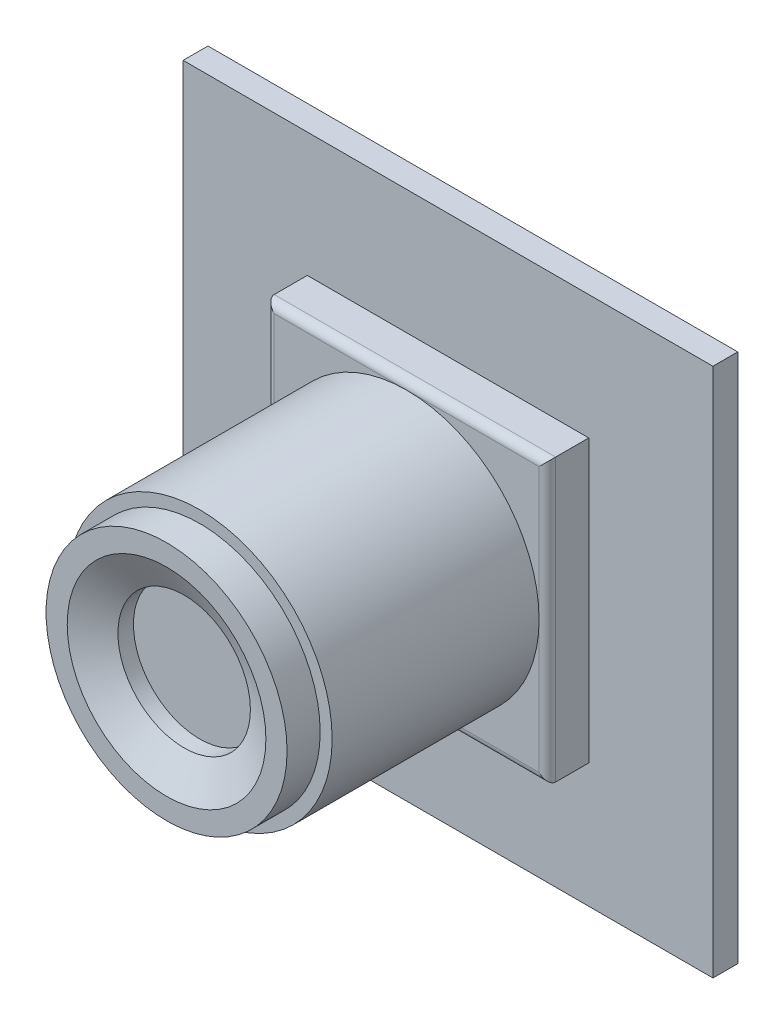
ISO-10303-21;
HEADER;
FILE_DESCRIPTION(('STEP AP214'),'2;1');
FILE_NAME('part.step','',(''),(''),'','','');
FILE_SCHEMA(('AUTOMOTIVE_DESIGN { 1 0 10303 214 1 1 1 1 }'));
ENDSEC;
DATA;
#1=APPLICATION_CONTEXT('core data for automotive mechanical design processes');
#2=APPLICATION_PROTOCOL_DEFINITION('international standard','automotive_design',2000,#1);
#3=PRODUCT_CONTEXT('',#1,'mechanical');
#4=PRODUCT('Part','Part','',(#3));
#5=PRODUCT_RELATED_PRODUCT_CATEGORY('part','',(#4));
#6=PRODUCT_DEFINITION_FORMATION('','',#4);
#7=PRODUCT_DEFINITION_CONTEXT('part definition',#1,'design');
#8=PRODUCT_DEFINITION('design','',#6,#7);
#9=PRODUCT_DEFINITION_SHAPE('','',#8);
#10=(LENGTH_UNIT() NAMED_UNIT(*) SI_UNIT(.MILLI.,.METRE.));
#11=(NAMED_UNIT(*) PLANE_ANGLE_UNIT() SI_UNIT($,.RADIAN.));
#12=(NAMED_UNIT(*) SI_UNIT($,.STERADIAN.) SOLID_ANGLE_UNIT());
#13=UNCERTAINTY_MEASURE_WITH_UNIT(LENGTH_MEASURE(1.E-05),#10,'distance_accuracy_value','');
#14=(GEOMETRIC_REPRESENTATION_CONTEXT(3) GLOBAL_UNCERTAINTY_ASSIGNED_CONTEXT((#13)) GLOBAL_UNIT_ASSIGNED_CONTEXT((#10,
#11,#12)) REPRESENTATION_CONTEXT('',''));
#15=CARTESIAN_POINT('',(0.,0.,0.));
#16=DIRECTION('',(0.,0.,1.));
#17=DIRECTION('',(1.,0.,0.));
#18=AXIS2_PLACEMENT_3D('',#15,#16,#17);
#19=CARTESIAN_POINT('',(0.,0.,4.));
#20=DIRECTION('',(0.,0.,-1.));
#21=DIRECTION('',(-1.,0.,0.));
#22=AXIS2_PLACEMENT_3D('',#19,#20,#21);
#23=PLANE('',#22);
#24=DIRECTION('',(0.,-1.,0.));
#25=VECTOR('',#24,1.);
#26=CARTESIAN_POINT('',(-8.,0.,4.));
#27=LINE('',#26,#25);
#28=CARTESIAN_POINT('',(-8.,0.,4.));
#29=VERTEX_POINT('',#28);
#30=CARTESIAN_POINT('',(-8.,-8.,4.));
#31=VERTEX_POINT('',#30);
#32=EDGE_CURVE('E207',#29,#31,#27,.T.);
#33=ORIENTED_EDGE('',*,*,#32,.T.);
#34=DIRECTION('',(1.,0.,0.));
#35=VECTOR('',#34,1.);
#36=CARTESIAN_POINT('',(0.,-8.,4.));
#37=LINE('',#36,#35);
#38=CARTESIAN_POINT('',(0.,-8.,4.));
#39=VERTEX_POINT('',#38);
#40=EDGE_CURVE('E211',#31,#39,#37,.T.);
#41=ORIENTED_EDGE('',*,*,#40,.T.);
#42=CARTESIAN_POINT('',(0.,0.,4.));
#43=DIRECTION('',(0.,0.,-1.));
#44=DIRECTION('',(-1.,0.,0.));
#45=AXIS2_PLACEMENT_3D('',#42,#43,#44);
#46=CIRCLE('',#45,8.);
#47=EDGE_CURVE('E186',#29,#39,#46,.F.);
#48=ORIENTED_EDGE('',*,*,#47,.F.);
#49=EDGE_LOOP('',(#33,#41,#48));
#50=FACE_BOUND('',#49,.T.);
#51=ADVANCED_FACE('F33',(#50),#23,.F.);
#52=CARTESIAN_POINT('',(8.,0.,4.));
#53=VERTEX_POINT('',#52);
#54=EDGE_CURVE('E190',#39,#53,#46,.F.);
#55=ORIENTED_EDGE('',*,*,#54,.F.);
#56=DIRECTION('',(1.,0.,0.));
#57=VECTOR('',#56,1.);
#58=CARTESIAN_POINT('',(0.,-8.,4.));
#59=LINE('',#58,#57);
#60=CARTESIAN_POINT('',(8.,-8.,4.));
#61=VERTEX_POINT('',#60);
#62=EDGE_CURVE('E209',#39,#61,#59,.T.);
#63=ORIENTED_EDGE('',*,*,#62,.T.);
#64=DIRECTION('',(0.,1.,0.));
#65=VECTOR('',#64,1.);
#66=CARTESIAN_POINT('',(8.,0.,4.));
#67=LINE('',#66,#65);
#68=EDGE_CURVE('E204',#61,#53,#67,.T.);
#69=ORIENTED_EDGE('',*,*,#68,.T.);
#70=EDGE_LOOP('',(#55,#63,#69));
#71=FACE_BOUND('',#70,.T.);
#72=ADVANCED_FACE('F269',(#71),#23,.F.);
#73=CARTESIAN_POINT('',(0.,8.,4.));
#74=VERTEX_POINT('',#73);
#75=EDGE_CURVE('E257',#53,#74,#46,.F.);
#76=ORIENTED_EDGE('',*,*,#75,.F.);
#77=DIRECTION('',(0.,1.,0.));
#78=VECTOR('',#77,1.);
#79=CARTESIAN_POINT('',(8.,0.,4.));
#80=LINE('',#79,#78);
#81=CARTESIAN_POINT('',(8.,8.,4.));
#82=VERTEX_POINT('',#81);
#83=EDGE_CURVE('E202',#53,#82,#80,.T.);
#84=ORIENTED_EDGE('',*,*,#83,.T.);
#85=DIRECTION('',(-1.,0.,0.));
#86=VECTOR('',#85,1.);
#87=CARTESIAN_POINT('',(0.,8.,4.));
#88=LINE('',#87,#86);
#89=EDGE_CURVE('E198',#82,#74,#88,.T.);
#90=ORIENTED_EDGE('',*,*,#89,.T.);
#91=EDGE_LOOP('',(#76,#84,#90));
#92=FACE_BOUND('',#91,.T.);
#93=ADVANCED_FACE('F255',(#92),#23,.F.);
#94=CARTESIAN_POINT('',(0.,0.,16.5));
#95=DIRECTION('',(0.,0.,1.));
#96=DIRECTION('',(1.,0.,0.));
#97=AXIS2_PLACEMENT_3D('',#94,#95,#96);
#98=PLANE('',#97);
#99=CARTESIAN_POINT('',(0.,0.,16.5));
#100=DIRECTION('',(0.,0.,1.));
#101=DIRECTION('',(1.,0.,0.));
#102=AXIS2_PLACEMENT_3D('',#99,#100,#101);
#103=CIRCLE('',#102,8.);
#104=CARTESIAN_POINT('',(8.,0.,16.5));
#105=VERTEX_POINT('',#104);
#106=EDGE_CURVE('E142',#105,#105,#103,.T.);
#107=ORIENTED_EDGE('',*,*,#106,.T.);
#108=EDGE_LOOP('',(#107));
#109=FACE_BOUND('',#108,.T.);
#110=CARTESIAN_POINT('',(0.,0.,16.5));
#111=DIRECTION('',(0.,0.,1.));
#112=DIRECTION('',(1.,0.,0.));
#113=AXIS2_PLACEMENT_3D('',#110,#111,#112);
#114=CIRCLE('',#113,7.27777031450188);
#115=CARTESIAN_POINT('',(7.27777031450188,0.,16.5));
#116=VERTEX_POINT('',#115);
#117=EDGE_CURVE('E232',#116,#116,#114,.T.);
#118=ORIENTED_EDGE('',*,*,#117,.F.);
#119=EDGE_LOOP('',(#118));
#120=FACE_BOUND('',#119,.T.);
#121=ADVANCED_FACE('F288',(#109,#120),#98,.T.);
#122=DIRECTION('',(-1.,0.,0.));
#123=VECTOR('',#122,1.);
#124=CARTESIAN_POINT('',(0.,8.,4.));
#125=LINE('',#124,#123);
#126=CARTESIAN_POINT('',(-8.,8.,4.));
#127=VERTEX_POINT('',#126);
#128=EDGE_CURVE('E196',#74,#127,#125,.T.);
#129=ORIENTED_EDGE('',*,*,#128,.T.);
#130=DIRECTION('',(0.,-1.,0.));
#131=VECTOR('',#130,1.);
#132=CARTESIAN_POINT('',(-8.,0.,4.));
#133=LINE('',#132,#131);
#134=EDGE_CURVE('E200',#127,#29,#133,.T.);
#135=ORIENTED_EDGE('',*,*,#134,.T.);
#136=EDGE_CURVE('E185',#74,#29,#46,.F.);
#137=ORIENTED_EDGE('',*,*,#136,.F.);
#138=EDGE_LOOP('',(#129,#135,#137));
#139=FACE_BOUND('',#138,.T.);
#140=ADVANCED_FACE('F261',(#139),#23,.F.);
#141=CARTESIAN_POINT('',(0.,0.,1.5));
#142=DIRECTION('',(0.,0.,-1.));
#143=DIRECTION('',(-1.,0.,0.));
#144=AXIS2_PLACEMENT_3D('',#141,#142,#143);
#145=PLANE('',#144);
#146=DIRECTION('',(0.,1.,0.));
#147=VECTOR('',#146,1.);
#148=CARTESIAN_POINT('',(16.,-16.,1.5));
#149=LINE('',#148,#147);
#150=CARTESIAN_POINT('',(16.,-16.,1.5));
#151=VERTEX_POINT('',#150);
#152=CARTESIAN_POINT('',(16.,16.,1.5));
#153=VERTEX_POINT('',#152);
#154=EDGE_CURVE('E156',#151,#153,#149,.T.);
#155=ORIENTED_EDGE('',*,*,#154,.T.);
#156=DIRECTION('',(-1.,0.,0.));
#157=VECTOR('',#156,1.);
#158=CARTESIAN_POINT('',(-16.,16.,1.5));
#159=LINE('',#158,#157);
#160=CARTESIAN_POINT('',(-16.,16.,1.5));
#161=VERTEX_POINT('',#160);
#162=EDGE_CURVE('E159',#153,#161,#159,.T.);
#163=ORIENTED_EDGE('',*,*,#162,.T.);
#164=DIRECTION('',(0.,-1.,0.));
#165=VECTOR('',#164,1.);
#166=CARTESIAN_POINT('',(-16.,-16.,1.5));
#167=LINE('',#166,#165);
#168=CARTESIAN_POINT('',(-16.,-16.,1.5));
#169=VERTEX_POINT('',#168);
#170=EDGE_CURVE('E162',#161,#169,#167,.T.);
#171=ORIENTED_EDGE('',*,*,#170,.T.);
#172=DIRECTION('',(1.,0.,0.));
#173=VECTOR('',#172,1.);
#174=CARTESIAN_POINT('',(-16.,-16.,1.5));
#175=LINE('',#174,#173);
#176=EDGE_CURVE('E164',#169,#151,#175,.T.);
#177=ORIENTED_EDGE('',*,*,#176,.T.);
#178=EDGE_LOOP('',(#155,#163,#171,#177));
#179=FACE_BOUND('',#178,.T.);
#180=DIRECTION('',(0.,1.,0.));
#181=VECTOR('',#180,1.);
#182=CARTESIAN_POINT('',(8.5,-8.5,1.5));
#183=LINE('',#182,#181);
#184=CARTESIAN_POINT('',(8.5,-8.5,1.5));
#185=VERTEX_POINT('',#184);
#186=CARTESIAN_POINT('',(8.5,8.5,1.5));
#187=VERTEX_POINT('',#186);
#188=EDGE_CURVE('E127',#185,#187,#183,.T.);
#189=ORIENTED_EDGE('',*,*,#188,.F.);
#190=DIRECTION('',(1.,0.,0.));
#191=VECTOR('',#190,1.);
#192=CARTESIAN_POINT('',(-8.5,-8.5,1.5));
#193=LINE('',#192,#191);
#194=CARTESIAN_POINT('',(-8.5,-8.5,1.5));
#195=VERTEX_POINT('',#194);
#196=EDGE_CURVE('E132',#195,#185,#193,.T.);
#197=ORIENTED_EDGE('',*,*,#196,.F.);
#198=DIRECTION('',(0.,-1.,0.));
#199=VECTOR('',#198,1.);
#200=CARTESIAN_POINT('',(-8.5,-8.5,1.5));
#201=LINE('',#200,#199);
#202=CARTESIAN_POINT('',(-8.5,8.5,1.5));
#203=VERTEX_POINT('',#202);
#204=EDGE_CURVE('E145',#203,#195,#201,.T.);
#205=ORIENTED_EDGE('',*,*,#204,.F.);
#206=DIRECTION('',(-1.,0.,0.));
#207=VECTOR('',#206,1.);
#208=CARTESIAN_POINT('',(-8.5,8.5,1.5));
#209=LINE('',#208,#207);
#210=EDGE_CURVE('E141',#187,#203,#209,.T.);
#211=ORIENTED_EDGE('',*,*,#210,.F.);
#212=EDGE_LOOP('',(#189,#197,#205,#211));
#213=FACE_BOUND('',#212,.T.);
#214=ADVANCED_FACE('F137',(#179,#213),#145,.F.);
#215=CARTESIAN_POINT('',(16.,-16.,1.5));
#216=DIRECTION('',(-1.,0.,0.));
#217=DIRECTION('',(0.,0.,1.));
#218=AXIS2_PLACEMENT_3D('',#215,#216,#217);
#219=PLANE('',#218);
#220=DIRECTION('',(0.,1.,0.));
#221=VECTOR('',#220,1.);
#222=CARTESIAN_POINT('',(16.,-16.,0.));
#223=LINE('',#222,#221);
#224=CARTESIAN_POINT('',(16.,-16.,0.));
#225=VERTEX_POINT('',#224);
#226=CARTESIAN_POINT('',(16.,16.,0.));
#227=VERTEX_POINT('',#226);
#228=EDGE_CURVE('E155',#225,#227,#223,.T.);
#229=ORIENTED_EDGE('',*,*,#228,.T.);
#230=DIRECTION('',(0.,0.,-1.));
#231=VECTOR('',#230,1.);
#232=CARTESIAN_POINT('',(16.,16.,1.5));
#233=LINE('',#232,#231);
#234=EDGE_CURVE('E182',#153,#227,#233,.T.);
#235=ORIENTED_EDGE('',*,*,#234,.F.);
#236=ORIENTED_EDGE('',*,*,#154,.F.);
#237=DIRECTION('',(0.,0.,-1.));
#238=VECTOR('',#237,1.);
#239=CARTESIAN_POINT('',(16.,-16.,1.5));
#240=LINE('',#239,#238);
#241=EDGE_CURVE('E166',#151,#225,#240,.T.);
#242=ORIENTED_EDGE('',*,*,#241,.T.);
#243=EDGE_LOOP('',(#229,#235,#236,#242));
#244=FACE_BOUND('',#243,.T.);
#245=ADVANCED_FACE('F293',(#244),#219,.F.);
#246=CARTESIAN_POINT('',(-16.,16.,1.5));
#247=DIRECTION('',(0.,-1.,0.));
#248=DIRECTION('',(0.,0.,-1.));
#249=AXIS2_PLACEMENT_3D('',#246,#247,#248);
#250=PLANE('',#249);
#251=DIRECTION('',(-1.,0.,0.));
#252=VECTOR('',#251,1.);
#253=CARTESIAN_POINT('',(-16.,16.,0.));
#254=LINE('',#253,#252);
#255=CARTESIAN_POINT('',(-16.,16.,0.));
#256=VERTEX_POINT('',#255);
#257=EDGE_CURVE('E169',#227,#256,#254,.T.);
#258=ORIENTED_EDGE('',*,*,#257,.T.);
#259=DIRECTION('',(0.,0.,-1.));
#260=VECTOR('',#259,1.);
#261=CARTESIAN_POINT('',(-16.,16.,1.5));
#262=LINE('',#261,#260);
#263=EDGE_CURVE('E179',#161,#256,#262,.T.);
#264=ORIENTED_EDGE('',*,*,#263,.F.);
#265=ORIENTED_EDGE('',*,*,#162,.F.);
#266=ORIENTED_EDGE('',*,*,#234,.T.);
#267=EDGE_LOOP('',(#258,#264,#265,#266));
#268=FACE_BOUND('',#267,.T.);
#269=ADVANCED_FACE('F402',(#268),#250,.F.);
#270=CARTESIAN_POINT('',(-16.,-16.,1.5));
#271=DIRECTION('',(1.,0.,0.));
#272=DIRECTION('',(0.,0.,-1.));
#273=AXIS2_PLACEMENT_3D('',#270,#271,#272);
#274=PLANE('',#273);
#275=DIRECTION('',(0.,-1.,0.));
#276=VECTOR('',#275,1.);
#277=CARTESIAN_POINT('',(-16.,-16.,0.));
#278=LINE('',#277,#276);
#279=CARTESIAN_POINT('',(-16.,-16.,0.));
#280=VERTEX_POINT('',#279);
#281=EDGE_CURVE('E171',#256,#280,#278,.T.);
#282=ORIENTED_EDGE('',*,*,#281,.T.);
#283=DIRECTION('',(0.,0.,-1.));
#284=VECTOR('',#283,1.);
#285=CARTESIAN_POINT('',(-16.,-16.,1.5));
#286=LINE('',#285,#284);
#287=EDGE_CURVE('E176',#169,#280,#286,.T.);
#288=ORIENTED_EDGE('',*,*,#287,.F.);
#289=ORIENTED_EDGE('',*,*,#170,.F.);
#290=ORIENTED_EDGE('',*,*,#263,.T.);
#291=EDGE_LOOP('',(#282,#288,#289,#290));
#292=FACE_BOUND('',#291,.T.);
#293=ADVANCED_FACE('F406',(#292),#274,.F.);
#294=CARTESIAN_POINT('',(-16.,-16.,1.5));
#295=DIRECTION('',(0.,1.,0.));
#296=DIRECTION('',(0.,0.,1.));
#297=AXIS2_PLACEMENT_3D('',#294,#295,#296);
#298=PLANE('',#297);
#299=DIRECTION('',(1.,0.,0.));
#300=VECTOR('',#299,1.);
#301=CARTESIAN_POINT('',(-16.,-16.,0.));
#302=LINE('',#301,#300);
#303=EDGE_CURVE('E160',#280,#225,#302,.T.);
#304=ORIENTED_EDGE('',*,*,#303,.T.);
#305=ORIENTED_EDGE('',*,*,#241,.F.);
#306=ORIENTED_EDGE('',*,*,#176,.F.);
#307=ORIENTED_EDGE('',*,*,#287,.T.);
#308=EDGE_LOOP('',(#304,#305,#306,#307));
#309=FACE_BOUND('',#308,.T.);
#310=ADVANCED_FACE('F410',(#309),#298,.F.);
#311=CARTESIAN_POINT('',(0.,0.,0.));
#312=DIRECTION('',(0.,0.,-1.));
#313=DIRECTION('',(-1.,0.,0.));
#314=AXIS2_PLACEMENT_3D('',#311,#312,#313);
#315=PLANE('',#314);
#316=ORIENTED_EDGE('',*,*,#228,.F.);
#317=ORIENTED_EDGE('',*,*,#303,.F.);
#318=ORIENTED_EDGE('',*,*,#281,.F.);
#319=ORIENTED_EDGE('',*,*,#257,.F.);
#320=EDGE_LOOP('',(#316,#317,#318,#319));
#321=FACE_BOUND('',#320,.T.);
#322=ADVANCED_FACE('F414',(#321),#315,.T.);
#323=CARTESIAN_POINT('',(8.5,-8.5,4.));
#324=DIRECTION('',(-1.,0.,0.));
#325=DIRECTION('',(0.,0.,1.));
#326=AXIS2_PLACEMENT_3D('',#323,#324,#325);
#327=PLANE('',#326);
#328=DIRECTION('',(0.,0.,-1.));
#329=VECTOR('',#328,1.);
#330=CARTESIAN_POINT('',(8.5,8.5,4.));
#331=LINE('',#330,#329);
#332=CARTESIAN_POINT('',(8.5,8.5,3.5));
#333=VERTEX_POINT('',#332);
#334=EDGE_CURVE('E153',#333,#187,#331,.T.);
#335=ORIENTED_EDGE('',*,*,#334,.F.);
#336=DIRECTION('',(0.,1.,0.));
#337=VECTOR('',#336,1.);
#338=CARTESIAN_POINT('',(8.5,-8.5,3.5));
#339=LINE('',#338,#337);
#340=CARTESIAN_POINT('',(8.5,-8.5,3.5));
#341=VERTEX_POINT('',#340);
#342=EDGE_CURVE('E129',#333,#341,#339,.F.);
#343=ORIENTED_EDGE('',*,*,#342,.T.);
#344=DIRECTION('',(0.,0.,-1.));
#345=VECTOR('',#344,1.);
#346=CARTESIAN_POINT('',(8.5,-8.5,4.));
#347=LINE('',#346,#345);
#348=EDGE_CURVE('E123',#341,#185,#347,.T.);
#349=ORIENTED_EDGE('',*,*,#348,.T.);
#350=ORIENTED_EDGE('',*,*,#188,.T.);
#351=EDGE_LOOP('',(#335,#343,#349,#350));
#352=FACE_BOUND('',#351,.T.);
#353=ADVANCED_FACE('F126',(#352),#327,.F.);
#354=CARTESIAN_POINT('',(-8.5,8.5,4.));
#355=DIRECTION('',(0.,-1.,0.));
#356=DIRECTION('',(0.,0.,-1.));
#357=AXIS2_PLACEMENT_3D('',#354,#355,#356);
#358=PLANE('',#357);
#359=DIRECTION('',(0.,0.,-1.));
#360=VECTOR('',#359,1.);
#361=CARTESIAN_POINT('',(-8.5,8.5,4.));
#362=LINE('',#361,#360);
#363=CARTESIAN_POINT('',(-8.5,8.5,3.5));
#364=VERTEX_POINT('',#363);
#365=EDGE_CURVE('E151',#364,#203,#362,.T.);
#366=ORIENTED_EDGE('',*,*,#365,.F.);
#367=DIRECTION('',(-1.,0.,0.));
#368=VECTOR('',#367,1.);
#369=CARTESIAN_POINT('',(-8.5,8.5,3.5));
#370=LINE('',#369,#368);
#371=EDGE_CURVE('E11',#364,#333,#370,.F.);
#372=ORIENTED_EDGE('',*,*,#371,.T.);
#373=ORIENTED_EDGE('',*,*,#334,.T.);
#374=ORIENTED_EDGE('',*,*,#210,.T.);
#375=EDGE_LOOP('',(#366,#372,#373,#374));
#376=FACE_BOUND('',#375,.T.);
#377=ADVANCED_FACE('F244',(#376),#358,.F.);
#378=CARTESIAN_POINT('',(-8.5,-8.5,4.));
#379=DIRECTION('',(1.,0.,0.));
#380=DIRECTION('',(0.,0.,-1.));
#381=AXIS2_PLACEMENT_3D('',#378,#379,#380);
#382=PLANE('',#381);
#383=DIRECTION('',(0.,0.,-1.));
#384=VECTOR('',#383,1.);
#385=CARTESIAN_POINT('',(-8.5,-8.5,4.));
#386=LINE('',#385,#384);
#387=CARTESIAN_POINT('',(-8.5,-8.5,3.5));
#388=VERTEX_POINT('',#387);
#389=EDGE_CURVE('E131',#388,#195,#386,.T.);
#390=ORIENTED_EDGE('',*,*,#389,.F.);
#391=DIRECTION('',(0.,-1.,0.));
#392=VECTOR('',#391,1.);
#393=CARTESIAN_POINT('',(-8.5,-8.5,3.5));
#394=LINE('',#393,#392);
#395=EDGE_CURVE('E42',#388,#364,#394,.F.);
#396=ORIENTED_EDGE('',*,*,#395,.T.);
#397=ORIENTED_EDGE('',*,*,#365,.T.);
#398=ORIENTED_EDGE('',*,*,#204,.T.);
#399=EDGE_LOOP('',(#390,#396,#397,#398));
#400=FACE_BOUND('',#399,.T.);
#401=ADVANCED_FACE('F423',(#400),#382,.F.);
#402=CARTESIAN_POINT('',(-8.5,-8.5,4.));
#403=DIRECTION('',(0.,1.,0.));
#404=DIRECTION('',(0.,0.,1.));
#405=AXIS2_PLACEMENT_3D('',#402,#403,#404);
#406=PLANE('',#405);
#407=ORIENTED_EDGE('',*,*,#348,.F.);
#408=DIRECTION('',(1.,0.,0.));
#409=VECTOR('',#408,1.);
#410=CARTESIAN_POINT('',(-8.5,-8.5,3.5));
#411=LINE('',#410,#409);
#412=EDGE_CURVE('E57',#341,#388,#411,.F.);
#413=ORIENTED_EDGE('',*,*,#412,.T.);
#414=ORIENTED_EDGE('',*,*,#389,.T.);
#415=ORIENTED_EDGE('',*,*,#196,.T.);
#416=EDGE_LOOP('',(#407,#413,#414,#415));
#417=FACE_BOUND('',#416,.T.);
#418=ADVANCED_FACE('F144',(#417),#406,.F.);
#419=CARTESIAN_POINT('',(0.,0.,16.5));
#420=DIRECTION('',(0.,0.,-1.));
#421=DIRECTION('',(-1.,0.,0.));
#422=AXIS2_PLACEMENT_3D('',#419,#420,#421);
#423=CYLINDRICAL_SURFACE('',#422,8.);
#424=ORIENTED_EDGE('',*,*,#106,.F.);
#425=EDGE_LOOP('',(#424));
#426=FACE_BOUND('',#425,.T.);
#427=ORIENTED_EDGE('',*,*,#47,.T.);
#428=ORIENTED_EDGE('',*,*,#54,.T.);
#429=ORIENTED_EDGE('',*,*,#75,.T.);
#430=ORIENTED_EDGE('',*,*,#136,.T.);
#431=EDGE_LOOP('',(#427,#428,#429,#430));
#432=FACE_BOUND('',#431,.T.);
#433=ADVANCED_FACE('F265',(#426,#432),#423,.T.);
#434=CARTESIAN_POINT('',(0.,0.,18.5));
#435=DIRECTION('',(0.,0.,-1.));
#436=DIRECTION('',(-1.,0.,0.));
#437=AXIS2_PLACEMENT_3D('',#434,#435,#436);
#438=CYLINDRICAL_SURFACE('',#437,7.27777031450188);
#439=CARTESIAN_POINT('',(0.,0.,18.5));
#440=DIRECTION('',(0.,0.,1.));
#441=DIRECTION('',(1.,0.,0.));
#442=AXIS2_PLACEMENT_3D('',#439,#440,#441);
#443=CIRCLE('',#442,7.27777031450188);
#444=CARTESIAN_POINT('',(7.27777031450188,0.,18.5));
#445=VERTEX_POINT('',#444);
#446=EDGE_CURVE('E237',#445,#445,#443,.T.);
#447=ORIENTED_EDGE('',*,*,#446,.F.);
#448=EDGE_LOOP('',(#447));
#449=FACE_BOUND('',#448,.T.);
#450=ORIENTED_EDGE('',*,*,#117,.T.);
#451=EDGE_LOOP('',(#450));
#452=FACE_BOUND('',#451,.T.);
#453=ADVANCED_FACE('F318',(#449,#452),#438,.T.);
#454=CARTESIAN_POINT('',(0.,0.,18.5));
#455=DIRECTION('',(0.,0.,1.));
#456=DIRECTION('',(1.,0.,0.));
#457=AXIS2_PLACEMENT_3D('',#454,#455,#456);
#458=PLANE('',#457);
#459=CARTESIAN_POINT('',(0.,0.,18.5));
#460=DIRECTION('',(0.,0.,1.));
#461=DIRECTION('',(1.,0.,0.));
#462=AXIS2_PLACEMENT_3D('',#459,#460,#461);
#463=CIRCLE('',#462,6.00000000000001);
#464=CARTESIAN_POINT('',(6.00000000000001,0.,18.5));
#465=VERTEX_POINT('',#464);
#466=EDGE_CURVE('E193',#465,#465,#463,.F.);
#467=ORIENTED_EDGE('',*,*,#466,.T.);
#468=EDGE_LOOP('',(#467));
#469=FACE_BOUND('',#468,.T.);
#470=ORIENTED_EDGE('',*,*,#446,.T.);
#471=EDGE_LOOP('',(#470));
#472=FACE_BOUND('',#471,.T.);
#473=ADVANCED_FACE('F322',(#469,#472),#458,.T.);
#474=CARTESIAN_POINT('',(0.,0.,16.5));
#475=DIRECTION('',(0.,0.,1.));
#476=DIRECTION('',(1.,0.,0.));
#477=AXIS2_PLACEMENT_3D('',#474,#475,#476);
#478=CYLINDRICAL_SURFACE('',#477,4.);
#479=CARTESIAN_POINT('',(0.,0.,17.436581136677));
#480=DIRECTION('',(0.,0.,1.));
#481=DIRECTION('',(1.,0.,0.));
#482=AXIS2_PLACEMENT_3D('',#479,#480,#481);
#483=CIRCLE('',#482,4.);
#484=CARTESIAN_POINT('',(4.,0.,17.436581136677));
#485=VERTEX_POINT('',#484);
#486=EDGE_CURVE('E189',#485,#485,#483,.T.);
#487=ORIENTED_EDGE('',*,*,#486,.T.);
#488=EDGE_LOOP('',(#487));
#489=FACE_BOUND('',#488,.T.);
#490=CARTESIAN_POINT('',(0.,0.,16.5));
#491=DIRECTION('',(0.,0.,1.));
#492=DIRECTION('',(1.,0.,0.));
#493=AXIS2_PLACEMENT_3D('',#490,#491,#492);
#494=CIRCLE('',#493,4.);
#495=CARTESIAN_POINT('',(4.,0.,16.5));
#496=VERTEX_POINT('',#495);
#497=EDGE_CURVE('E227',#496,#496,#494,.T.);
#498=ORIENTED_EDGE('',*,*,#497,.F.);
#499=EDGE_LOOP('',(#498));
#500=FACE_BOUND('',#499,.T.);
#501=ADVANCED_FACE('F336',(#489,#500),#478,.F.);
#502=CARTESIAN_POINT('',(0.,0.,16.5));
#503=DIRECTION('',(0.,0.,1.));
#504=DIRECTION('',(1.,0.,0.));
#505=AXIS2_PLACEMENT_3D('',#502,#503,#504);
#506=PLANE('',#505);
#507=ORIENTED_EDGE('',*,*,#497,.T.);
#508=EDGE_LOOP('',(#507));
#509=FACE_BOUND('',#508,.T.);
#510=ADVANCED_FACE('F331',(#509),#506,.T.);
#511=CARTESIAN_POINT('',(0.,0.,17.436581136677));
#512=DIRECTION('',(0.,0.,1.));
#513=DIRECTION('',(1.,0.,0.));
#514=AXIS2_PLACEMENT_3D('',#511,#512,#513);
#515=CONICAL_SURFACE('',#514,4.,1.08210413623649);
#516=CARTESIAN_POINT('',(6.00000000000001,0.,18.5));
#517=CARTESIAN_POINT('',(5.97916666666667,0.,18.4889227201737));
#518=CARTESIAN_POINT('',(5.95833333333334,0.,18.4778454403474));
#519=CARTESIAN_POINT('',(5.91666666666667,0.,18.4556908806949));
#520=CARTESIAN_POINT('',(5.89583333333334,0.,18.4446136008686));
#521=CARTESIAN_POINT('',(5.85416666666667,0.,18.422459041216));
#522=CARTESIAN_POINT('',(5.83333333333334,0.,18.4113817613898));
#523=CARTESIAN_POINT('',(5.79166666666667,0.,18.3892272017372));
#524=CARTESIAN_POINT('',(5.77083333333334,0.,18.3781499219109));
#525=CARTESIAN_POINT('',(5.72916666666667,0.,18.3559953622583));
#526=CARTESIAN_POINT('',(5.70833333333334,0.,18.3449180824321));
#527=CARTESIAN_POINT('',(5.66666666666667,0.,18.3227635227795));
#528=CARTESIAN_POINT('',(5.64583333333334,0.,18.3116862429532));
#529=CARTESIAN_POINT('',(5.60416666666667,0.,18.2895316833007));
#530=CARTESIAN_POINT('',(5.58333333333334,0.,18.2784544034744));
#531=CARTESIAN_POINT('',(5.54166666666667,0.,18.2562998438218));
#532=CARTESIAN_POINT('',(5.52083333333334,0.,18.2452225639955));
#533=CARTESIAN_POINT('',(5.47916666666667,0.,18.223068004343));
#534=CARTESIAN_POINT('',(5.45833333333334,0.,18.2119907245167));
#535=CARTESIAN_POINT('',(5.41666666666667,0.,18.1898361648641));
#536=CARTESIAN_POINT('',(5.39583333333334,0.,18.1787588850379));
#537=CARTESIAN_POINT('',(5.35416666666667,0.,18.1566043253853));
#538=CARTESIAN_POINT('',(5.33333333333334,0.,18.145527045559));
#539=CARTESIAN_POINT('',(5.29166666666667,0.,18.1233724859065));
#540=CARTESIAN_POINT('',(5.27083333333334,0.,18.1122952060802));
#541=CARTESIAN_POINT('',(5.22916666666667,0.,18.0901406464276));
#542=CARTESIAN_POINT('',(5.20833333333334,0.,18.0790633666013));
#543=CARTESIAN_POINT('',(5.16666666666667,0.,18.0569088069488));
#544=CARTESIAN_POINT('',(5.14583333333334,0.,18.0458315271225));
#545=CARTESIAN_POINT('',(5.10416666666667,0.,18.0236769674699));
#546=CARTESIAN_POINT('',(5.08333333333334,0.,18.0125996876436));
#547=CARTESIAN_POINT('',(5.04166666666667,0.,17.9904451279911));
#548=CARTESIAN_POINT('',(5.02083333333334,0.,17.9793678481648));
#549=CARTESIAN_POINT('',(4.97916666666667,0.,17.9572132885122));
#550=CARTESIAN_POINT('',(4.95833333333334,0.,17.946136008686));
#551=CARTESIAN_POINT('',(4.91666666666667,0.,17.9239814490334));
#552=CARTESIAN_POINT('',(4.89583333333334,0.,17.9129041692071));
#553=CARTESIAN_POINT('',(4.85416666666667,0.,17.8907496095546));
#554=CARTESIAN_POINT('',(4.83333333333334,0.,17.8796723297283));
#555=CARTESIAN_POINT('',(4.79166666666667,0.,17.8575177700757));
#556=CARTESIAN_POINT('',(4.77083333333334,0.,17.8464404902494));
#557=CARTESIAN_POINT('',(4.72916666666667,0.,17.8242859305969));
#558=CARTESIAN_POINT('',(4.70833333333333,0.,17.8132086507706));
#559=CARTESIAN_POINT('',(4.66666666666667,0.,17.791054091118));
#560=CARTESIAN_POINT('',(4.64583333333333,0.,17.7799768112917));
#561=CARTESIAN_POINT('',(4.60416666666667,0.,17.7578222516392));
#562=CARTESIAN_POINT('',(4.58333333333333,0.,17.7467449718129));
#563=CARTESIAN_POINT('',(4.54166666666667,0.,17.7245904121603));
#564=CARTESIAN_POINT('',(4.52083333333333,0.,17.7135131323341));
#565=CARTESIAN_POINT('',(4.47916666666667,0.,17.6913585726815));
#566=CARTESIAN_POINT('',(4.45833333333333,0.,17.6802812928552));
#567=CARTESIAN_POINT('',(4.41666666666667,0.,17.6581267332027));
#568=CARTESIAN_POINT('',(4.39583333333333,0.,17.6470494533764));
#569=CARTESIAN_POINT('',(4.35416666666667,0.,17.6248948937238));
#570=CARTESIAN_POINT('',(4.33333333333333,0.,17.6138176138975));
#571=CARTESIAN_POINT('',(4.29166666666667,0.,17.591663054245));
#572=CARTESIAN_POINT('',(4.27083333333333,0.,17.5805857744187));
#573=CARTESIAN_POINT('',(4.22916666666667,0.,17.5584312147661));
#574=CARTESIAN_POINT('',(4.20833333333333,0.,17.5473539349399));
#575=CARTESIAN_POINT('',(4.16666666666666,0.,17.5251993752873));
#576=CARTESIAN_POINT('',(4.14583333333333,0.,17.514122095461));
#577=CARTESIAN_POINT('',(4.10416666666666,0.,17.4919675358084));
#578=CARTESIAN_POINT('',(4.08333333333333,0.,17.4808902559822));
#579=CARTESIAN_POINT('',(4.04166666666666,0.,17.4587356963296));
#580=CARTESIAN_POINT('',(4.02083333333333,0.,17.4476584165033));
#581=CARTESIAN_POINT('',(4.,0.,17.436581136677));
#582=B_SPLINE_CURVE_WITH_KNOTS('',3,(#516,#517,#518,#519,#520,#521,#522,#523,#524,#525,#526,
#527,#528,#529,#530,#531,#532,#533,#534,#535,#536,#537,#538,#539,#540,#541,#542,#543,#544,#545,
#546,#547,#548,#549,#550,#551,#552,#553,#554,#555,#556,#557,#558,#559,#560,#561,#562,#563,#564,
#565,#566,#567,#568,#569,#570,#571,#572,#573,#574,#575,#576,#577,#578,#579,#580,#581),
.UNSPECIFIED.,.F.,.F.,(4,2,2,2,2,2,2,2,2,2,2,2,2,2,2,2,2,2,2,2,2,2,2,2,2,2,2,2,2,2,2,2,4),(0.,
0.0707856281680649,0.14157125633613,0.212356884504195,0.28314251267226,0.353928140840326,
0.424713769008391,0.495499397176456,0.566285025344522,0.637070653512587,0.707856281680652,
0.778641909848717,0.849427538016782,0.920213166184848,0.990998794352913,1.06178442252098,
1.13257005068904,1.20335567885711,1.27414130702517,1.34492693519324,1.41571256336131,
1.48649819152937,1.55728381969744,1.6280694478655,1.69885507603357,1.76964070420163,
1.8404263323697,1.91121196053776,1.98199758870583,2.05278321687389,2.12356884504196,
2.19435447321002,2.26514010137809),.UNSPECIFIED.);
#583=EDGE_CURVE('BSEAM277',#465,#485,#582,.T.);
#584=ORIENTED_EDGE('',*,*,#466,.F.);
#585=ORIENTED_EDGE('',*,*,#486,.F.);
#586=ORIENTED_EDGE('',*,*,#583,.T.);
#587=ORIENTED_EDGE('',*,*,#583,.F.);
#588=EDGE_LOOP('',(#584,#586,#585,#587));
#589=FACE_BOUND('',#588,.T.);
#590=ADVANCED_FACE('F277',(#589),#515,.F.);
#591=CARTESIAN_POINT('',(-8.,0.,3.5));
#592=DIRECTION('',(0.,-1.,0.));
#593=DIRECTION('',(0.,0.,-1.));
#594=AXIS2_PLACEMENT_3D('',#591,#592,#593);
#595=CYLINDRICAL_SURFACE('',#594,0.5);
#596=CARTESIAN_POINT('',(-8.,8.,3.5));
#597=DIRECTION('',(-0.707106781186547,-0.707106781186547,0.));
#598=DIRECTION('',(-0.707106781186547,0.707106781186547,0.));
#599=AXIS2_PLACEMENT_3D('',#596,#597,#598);
#600=ELLIPSE('',#599,0.707106781186547,0.5);
#601=EDGE_CURVE('E220',#364,#127,#600,.F.);
#602=ORIENTED_EDGE('',*,*,#601,.F.);
#603=ORIENTED_EDGE('',*,*,#395,.F.);
#604=CARTESIAN_POINT('',(-8.,-8.,3.5));
#605=DIRECTION('',(0.707106781186547,-0.707106781186547,0.));
#606=DIRECTION('',(-0.707106781186547,-0.707106781186547,0.));
#607=AXIS2_PLACEMENT_3D('',#604,#605,#606);
#608=ELLIPSE('',#607,0.707106781186547,0.5);
#609=EDGE_CURVE('E37',#31,#388,#608,.T.);
#610=ORIENTED_EDGE('',*,*,#609,.F.);
#611=ORIENTED_EDGE('',*,*,#32,.F.);
#612=ORIENTED_EDGE('',*,*,#134,.F.);
#613=EDGE_LOOP('',(#602,#603,#610,#611,#612));
#614=FACE_BOUND('',#613,.T.);
#615=ADVANCED_FACE('F35',(#614),#595,.T.);
#616=CARTESIAN_POINT('',(0.,-8.,3.5));
#617=DIRECTION('',(1.,0.,0.));
#618=DIRECTION('',(0.,0.,-1.));
#619=AXIS2_PLACEMENT_3D('',#616,#617,#618);
#620=CYLINDRICAL_SURFACE('',#619,0.5);
#621=ORIENTED_EDGE('',*,*,#609,.T.);
#622=ORIENTED_EDGE('',*,*,#412,.F.);
#623=CARTESIAN_POINT('',(8.,-8.,3.5));
#624=DIRECTION('',(0.707106781186547,0.707106781186547,0.));
#625=DIRECTION('',(0.707106781186547,-0.707106781186547,0.));
#626=AXIS2_PLACEMENT_3D('',#623,#624,#625);
#627=ELLIPSE('',#626,0.707106781186547,0.5);
#628=EDGE_CURVE('E219',#61,#341,#627,.T.);
#629=ORIENTED_EDGE('',*,*,#628,.F.);
#630=ORIENTED_EDGE('',*,*,#62,.F.);
#631=ORIENTED_EDGE('',*,*,#40,.F.);
#632=EDGE_LOOP('',(#621,#622,#629,#630,#631));
#633=FACE_BOUND('',#632,.T.);
#634=ADVANCED_FACE('F270',(#633),#620,.T.);
#635=CARTESIAN_POINT('',(0.,8.,3.5));
#636=DIRECTION('',(-1.,0.,0.));
#637=DIRECTION('',(0.,0.,1.));
#638=AXIS2_PLACEMENT_3D('',#635,#636,#637);
#639=CYLINDRICAL_SURFACE('',#638,0.5);
#640=ORIENTED_EDGE('',*,*,#128,.F.);
#641=ORIENTED_EDGE('',*,*,#89,.F.);
#642=CARTESIAN_POINT('',(8.,8.,3.5));
#643=DIRECTION('',(-0.707106781186547,0.707106781186547,0.));
#644=DIRECTION('',(-0.707106781186547,-0.707106781186547,0.));
#645=AXIS2_PLACEMENT_3D('',#642,#643,#644);
#646=ELLIPSE('',#645,0.707106781186547,0.5);
#647=EDGE_CURVE('E216',#333,#82,#646,.F.);
#648=ORIENTED_EDGE('',*,*,#647,.F.);
#649=ORIENTED_EDGE('',*,*,#371,.F.);
#650=ORIENTED_EDGE('',*,*,#601,.T.);
#651=EDGE_LOOP('',(#640,#641,#648,#649,#650));
#652=FACE_BOUND('',#651,.T.);
#653=ADVANCED_FACE('F251',(#652),#639,.T.);
#654=CARTESIAN_POINT('',(8.,0.,3.5));
#655=DIRECTION('',(0.,1.,0.));
#656=DIRECTION('',(0.,0.,1.));
#657=AXIS2_PLACEMENT_3D('',#654,#655,#656);
#658=CYLINDRICAL_SURFACE('',#657,0.5);
#659=ORIENTED_EDGE('',*,*,#628,.T.);
#660=ORIENTED_EDGE('',*,*,#342,.F.);
#661=ORIENTED_EDGE('',*,*,#647,.T.);
#662=ORIENTED_EDGE('',*,*,#83,.F.);
#663=ORIENTED_EDGE('',*,*,#68,.F.);
#664=EDGE_LOOP('',(#659,#660,#661,#662,#663));
#665=FACE_BOUND('',#664,.T.);
#666=ADVANCED_FACE('F247',(#665),#658,.T.);
#667=CLOSED_SHELL('',(#51,#72,#93,#121,#140,#214,#245,#269,#293,#310,#322,#353,#377,#401,#418,
#433,#453,#473,#501,#510,#590,#615,#634,#653,#666));
#668=MANIFOLD_SOLID_BREP('B2',#667);
#669=ADVANCED_BREP_SHAPE_REPRESENTATION('',(#18,#668),#14);
#670=SHAPE_DEFINITION_REPRESENTATION(#9,#669);
ENDSEC;
END-ISO-10303-21;
